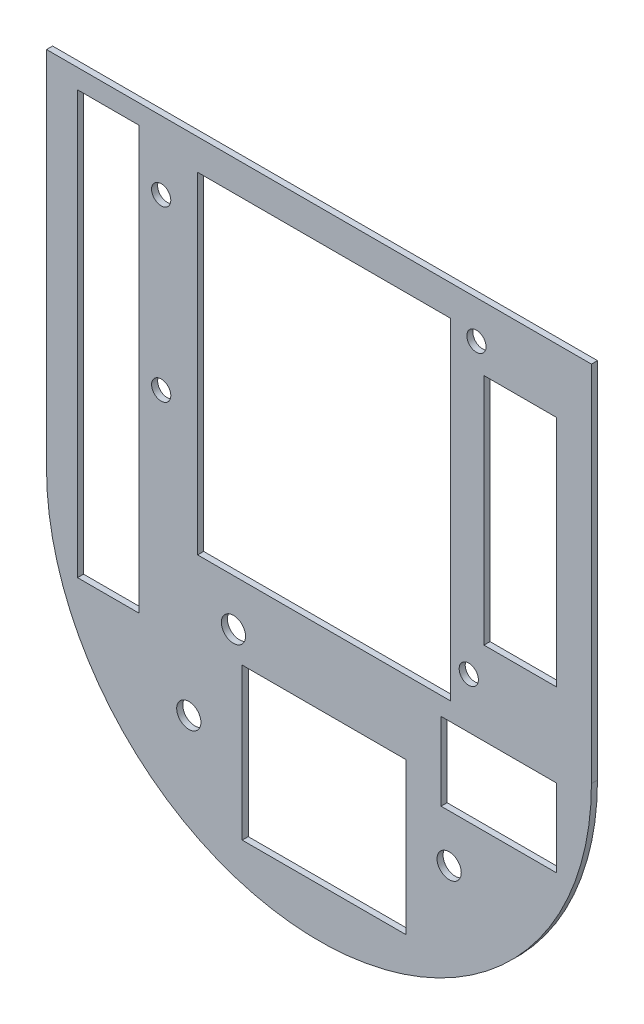
ISO-10303-21;
HEADER;
FILE_DESCRIPTION(('STEP AP214'),'2;1');
FILE_NAME('part.step','',(''),(''),'','','');
FILE_SCHEMA(('AUTOMOTIVE_DESIGN { 1 0 10303 214 1 1 1 1 }'));
ENDSEC;
DATA;
#1=APPLICATION_CONTEXT('core data for automotive mechanical design processes');
#2=APPLICATION_PROTOCOL_DEFINITION('international standard','automotive_design',2000,#1);
#3=PRODUCT_CONTEXT('',#1,'mechanical');
#4=PRODUCT('Part','Part','',(#3));
#5=PRODUCT_RELATED_PRODUCT_CATEGORY('part','',(#4));
#6=PRODUCT_DEFINITION_FORMATION('','',#4);
#7=PRODUCT_DEFINITION_CONTEXT('part definition',#1,'design');
#8=PRODUCT_DEFINITION('design','',#6,#7);
#9=PRODUCT_DEFINITION_SHAPE('','',#8);
#10=(LENGTH_UNIT() NAMED_UNIT(*) SI_UNIT(.MILLI.,.METRE.));
#11=(NAMED_UNIT(*) PLANE_ANGLE_UNIT() SI_UNIT($,.RADIAN.));
#12=(NAMED_UNIT(*) SI_UNIT($,.STERADIAN.) SOLID_ANGLE_UNIT());
#13=UNCERTAINTY_MEASURE_WITH_UNIT(LENGTH_MEASURE(1.E-05),#10,'distance_accuracy_value','');
#14=(GEOMETRIC_REPRESENTATION_CONTEXT(3) GLOBAL_UNCERTAINTY_ASSIGNED_CONTEXT((#13)) GLOBAL_UNIT_ASSIGNED_CONTEXT((#10,
#11,#12)) REPRESENTATION_CONTEXT('',''));
#15=CARTESIAN_POINT('',(0.,0.,0.));
#16=DIRECTION('',(0.,0.,1.));
#17=DIRECTION('',(1.,0.,0.));
#18=AXIS2_PLACEMENT_3D('',#15,#16,#17);
#19=CARTESIAN_POINT('',(16.1099960114476,-18.0642755711846,1.));
#20=DIRECTION('',(0.,0.,1.));
#21=DIRECTION('',(1.,0.,0.));
#22=AXIS2_PLACEMENT_3D('',#19,#20,#21);
#23=PLANE('',#22);
#24=DIRECTION('',(0.,1.,0.));
#25=VECTOR('',#24,1.);
#26=CARTESIAN_POINT('',(-13.5811824956844,-31.0485298295975,1.));
#27=LINE('',#26,#25);
#28=CARTESIAN_POINT('',(-13.5811824956844,-31.0485298295975,1.));
#29=VERTEX_POINT('',#28);
#30=CARTESIAN_POINT('',(-13.5811824956844,38.7363753081951,1.));
#31=VERTEX_POINT('',#30);
#32=EDGE_CURVE('E48',#29,#31,#27,.T.);
#33=ORIENTED_EDGE('',*,*,#32,.F.);
#34=DIRECTION('',(1.,0.,0.));
#35=VECTOR('',#34,1.);
#36=CARTESIAN_POINT('',(-23.773676610073,-31.0485298295975,1.));
#37=LINE('',#36,#35);
#38=CARTESIAN_POINT('',(-23.773676610073,-31.0485298295975,1.));
#39=VERTEX_POINT('',#38);
#40=EDGE_CURVE('E215',#39,#29,#37,.T.);
#41=ORIENTED_EDGE('',*,*,#40,.F.);
#42=DIRECTION('',(0.,-1.,0.));
#43=VECTOR('',#42,1.);
#44=CARTESIAN_POINT('',(-23.773676610073,-31.0485298295975,1.));
#45=LINE('',#44,#43);
#46=CARTESIAN_POINT('',(-23.773676610073,38.7363753081951,1.));
#47=VERTEX_POINT('',#46);
#48=EDGE_CURVE('E218',#47,#39,#45,.T.);
#49=ORIENTED_EDGE('',*,*,#48,.F.);
#50=DIRECTION('',(-1.,0.,0.));
#51=VECTOR('',#50,1.);
#52=CARTESIAN_POINT('',(-23.773676610073,38.7363753081951,1.));
#53=LINE('',#52,#51);
#54=EDGE_CURVE('E224',#31,#47,#53,.T.);
#55=ORIENTED_EDGE('',*,*,#54,.F.);
#56=EDGE_LOOP('',(#33,#41,#49,#55));
#57=FACE_BOUND('',#56,.T.);
#58=DIRECTION('',(0.,-1.,0.));
#59=VECTOR('',#58,1.);
#60=CARTESIAN_POINT('',(3.43092724596415,-54.9902553523783,1.));
#61=LINE('',#60,#59);
#62=CARTESIAN_POINT('',(3.43092724596415,-29.9521719844237,1.));
#63=VERTEX_POINT('',#62);
#64=CARTESIAN_POINT('',(3.43092724596415,-54.9902553523783,1.));
#65=VERTEX_POINT('',#64);
#66=EDGE_CURVE('E56',#63,#65,#61,.T.);
#67=ORIENTED_EDGE('',*,*,#66,.F.);
#68=DIRECTION('',(-1.,0.,0.));
#69=VECTOR('',#68,1.);
#70=CARTESIAN_POINT('',(30.4631942449948,-29.9521719844237,1.));
#71=LINE('',#70,#69);
#72=CARTESIAN_POINT('',(30.4631942449948,-29.9521719844237,1.));
#73=VERTEX_POINT('',#72);
#74=EDGE_CURVE('E239',#73,#63,#71,.T.);
#75=ORIENTED_EDGE('',*,*,#74,.F.);
#76=DIRECTION('',(0.,1.,0.));
#77=VECTOR('',#76,1.);
#78=CARTESIAN_POINT('',(30.4631942449948,-54.9902553523783,1.));
#79=LINE('',#78,#77);
#80=CARTESIAN_POINT('',(30.4631942449948,-54.9902553523783,1.));
#81=VERTEX_POINT('',#80);
#82=EDGE_CURVE('E254',#81,#73,#79,.T.);
#83=ORIENTED_EDGE('',*,*,#82,.F.);
#84=DIRECTION('',(1.,0.,0.));
#85=VECTOR('',#84,1.);
#86=CARTESIAN_POINT('',(30.4631942449948,-54.9902553523783,1.));
#87=LINE('',#86,#85);
#88=EDGE_CURVE('E250',#65,#81,#87,.T.);
#89=ORIENTED_EDGE('',*,*,#88,.F.);
#90=EDGE_LOOP('',(#67,#75,#83,#89));
#91=FACE_BOUND('',#90,.T.);
#92=DIRECTION('',(0.,1.,0.));
#93=VECTOR('',#92,1.);
#94=CARTESIAN_POINT('',(55.3289407559428,-7.12984820655362,1.));
#95=LINE('',#94,#93);
#96=CARTESIAN_POINT('',(55.3289407559428,-7.12984820655362,1.));
#97=VERTEX_POINT('',#96);
#98=CARTESIAN_POINT('',(55.3289407559428,31.4243686609163,1.));
#99=VERTEX_POINT('',#98);
#100=EDGE_CURVE('E279',#97,#99,#95,.T.);
#101=ORIENTED_EDGE('',*,*,#100,.F.);
#102=DIRECTION('',(1.,0.,0.));
#103=VECTOR('',#102,1.);
#104=CARTESIAN_POINT('',(43.3638389694866,-7.12984820655362,1.));
#105=LINE('',#104,#103);
#106=CARTESIAN_POINT('',(43.3638389694866,-7.12984820655362,1.));
#107=VERTEX_POINT('',#106);
#108=EDGE_CURVE('E269',#107,#97,#105,.T.);
#109=ORIENTED_EDGE('',*,*,#108,.F.);
#110=DIRECTION('',(0.,-1.,0.));
#111=VECTOR('',#110,1.);
#112=CARTESIAN_POINT('',(43.3638389694866,-7.12984820655362,1.));
#113=LINE('',#112,#111);
#114=CARTESIAN_POINT('',(43.3638389694866,31.4243686609163,1.));
#115=VERTEX_POINT('',#114);
#116=EDGE_CURVE('E285',#115,#107,#113,.T.);
#117=ORIENTED_EDGE('',*,*,#116,.F.);
#118=DIRECTION('',(-1.,0.,0.));
#119=VECTOR('',#118,1.);
#120=CARTESIAN_POINT('',(43.3638389694866,31.4243686609163,1.));
#121=LINE('',#120,#119);
#122=EDGE_CURVE('E281',#99,#115,#121,.T.);
#123=ORIENTED_EDGE('',*,*,#122,.F.);
#124=EDGE_LOOP('',(#101,#109,#117,#123));
#125=FACE_BOUND('',#124,.T.);
#126=DIRECTION('',(0.,1.,0.));
#127=VECTOR('',#126,1.);
#128=CARTESIAN_POINT('',(55.3289407559428,-33.7189632875673,1.));
#129=LINE('',#128,#127);
#130=CARTESIAN_POINT('',(55.3289407559428,-33.7189632875673,1.));
#131=VERTEX_POINT('',#130);
#132=CARTESIAN_POINT('',(55.3289407559428,-20.8675576650774,1.));
#133=VERTEX_POINT('',#132);
#134=EDGE_CURVE('E311',#131,#133,#129,.T.);
#135=ORIENTED_EDGE('',*,*,#134,.F.);
#136=DIRECTION('',(1.,0.,0.));
#137=VECTOR('',#136,1.);
#138=CARTESIAN_POINT('',(36.2734082812163,-33.7189632875673,1.));
#139=LINE('',#138,#137);
#140=CARTESIAN_POINT('',(36.2734082812163,-33.7189632875673,1.));
#141=VERTEX_POINT('',#140);
#142=EDGE_CURVE('E301',#141,#131,#139,.T.);
#143=ORIENTED_EDGE('',*,*,#142,.F.);
#144=DIRECTION('',(0.,-1.,0.));
#145=VECTOR('',#144,1.);
#146=CARTESIAN_POINT('',(36.2734082812163,-33.7189632875673,1.));
#147=LINE('',#146,#145);
#148=CARTESIAN_POINT('',(36.2734082812163,-20.8675576650774,1.));
#149=VERTEX_POINT('',#148);
#150=EDGE_CURVE('E316',#149,#141,#147,.T.);
#151=ORIENTED_EDGE('',*,*,#150,.F.);
#152=DIRECTION('',(-1.,0.,0.));
#153=VECTOR('',#152,1.);
#154=CARTESIAN_POINT('',(36.2734082812163,-20.8675576650774,1.));
#155=LINE('',#154,#153);
#156=EDGE_CURVE('E313',#133,#149,#155,.T.);
#157=ORIENTED_EDGE('',*,*,#156,.F.);
#158=EDGE_LOOP('',(#135,#143,#151,#157));
#159=FACE_BOUND('',#158,.T.);
#160=DIRECTION('',(0.,-1.,0.));
#161=VECTOR('',#160,1.);
#162=CARTESIAN_POINT('',(-3.93031850331651,-17.8762822184633,1.));
#163=LINE('',#162,#161);
#164=CARTESIAN_POINT('',(-3.93031850331651,36.8529796566232,1.));
#165=VERTEX_POINT('',#164);
#166=CARTESIAN_POINT('',(-3.93031850331651,-17.8762822184633,1.));
#167=VERTEX_POINT('',#166);
#168=EDGE_CURVE('E231',#165,#167,#163,.T.);
#169=ORIENTED_EDGE('',*,*,#168,.F.);
#170=DIRECTION('',(-1.,0.,0.));
#171=VECTOR('',#170,1.);
#172=CARTESIAN_POINT('',(37.8244399942754,36.8529796566232,1.));
#173=LINE('',#172,#171);
#174=CARTESIAN_POINT('',(37.8244399942754,36.8529796566232,1.));
#175=VERTEX_POINT('',#174);
#176=EDGE_CURVE('E332',#175,#165,#173,.T.);
#177=ORIENTED_EDGE('',*,*,#176,.F.);
#178=DIRECTION('',(0.,1.,0.));
#179=VECTOR('',#178,1.);
#180=CARTESIAN_POINT('',(37.8244399942754,-17.8762822184633,1.));
#181=LINE('',#180,#179);
#182=CARTESIAN_POINT('',(37.8244399942754,-17.8762822184633,1.));
#183=VERTEX_POINT('',#182);
#184=EDGE_CURVE('E346',#183,#175,#181,.T.);
#185=ORIENTED_EDGE('',*,*,#184,.F.);
#186=DIRECTION('',(1.,0.,0.));
#187=VECTOR('',#186,1.);
#188=CARTESIAN_POINT('',(37.8244399942754,-17.8762822184633,1.));
#189=LINE('',#188,#187);
#190=EDGE_CURVE('E343',#167,#183,#189,.T.);
#191=ORIENTED_EDGE('',*,*,#190,.F.);
#192=EDGE_LOOP('',(#169,#177,#185,#191));
#193=FACE_BOUND('',#192,.T.);
#194=CARTESIAN_POINT('',(42.1199960114471,35.7118361233288,1.));
#195=DIRECTION('',(0.,0.,1.));
#196=DIRECTION('',(1.,0.,0.));
#197=AXIS2_PLACEMENT_3D('',#194,#195,#196);
#198=CIRCLE('',#197,1.5875);
#199=CARTESIAN_POINT('',(43.7074960114471,35.7118361233288,1.));
#200=VERTEX_POINT('',#199);
#201=EDGE_CURVE('E366',#200,#200,#198,.T.);
#202=ORIENTED_EDGE('',*,*,#201,.F.);
#203=EDGE_LOOP('',(#202));
#204=FACE_BOUND('',#203,.T.);
#205=CARTESIAN_POINT('',(-9.95000398855292,2.69183612332877,1.));
#206=DIRECTION('',(0.,0.,1.));
#207=DIRECTION('',(1.,0.,0.));
#208=AXIS2_PLACEMENT_3D('',#205,#206,#207);
#209=CIRCLE('',#208,1.58750000000001);
#210=CARTESIAN_POINT('',(-8.36250398855291,2.69183612332877,1.));
#211=VERTEX_POINT('',#210);
#212=EDGE_CURVE('E378',#211,#211,#209,.T.);
#213=ORIENTED_EDGE('',*,*,#212,.F.);
#214=EDGE_LOOP('',(#213));
#215=FACE_BOUND('',#214,.T.);
#216=CARTESIAN_POINT('',(-5.39000398855241,-41.5642755711846,1.));
#217=DIRECTION('',(0.,0.,1.));
#218=DIRECTION('',(1.,0.,0.));
#219=AXIS2_PLACEMENT_3D('',#216,#217,#218);
#220=CIRCLE('',#219,2.);
#221=CARTESIAN_POINT('',(-3.39000398855241,-41.5642755711846,1.));
#222=VERTEX_POINT('',#221);
#223=EDGE_CURVE('E390',#222,#222,#220,.T.);
#224=ORIENTED_EDGE('',*,*,#223,.F.);
#225=EDGE_LOOP('',(#224));
#226=FACE_BOUND('',#225,.T.);
#227=DIRECTION('',(-1.,0.,0.));
#228=VECTOR('',#227,1.);
#229=CARTESIAN_POINT('',(61.1099960114476,41.9357244288154,1.));
#230=LINE('',#229,#228);
#231=CARTESIAN_POINT('',(61.1099960114476,41.9357244288154,1.));
#232=VERTEX_POINT('',#231);
#233=CARTESIAN_POINT('',(-28.8900039885524,41.9357244288154,1.));
#234=VERTEX_POINT('',#233);
#235=EDGE_CURVE('E402',#232,#234,#230,.T.);
#236=ORIENTED_EDGE('',*,*,#235,.T.);
#237=DIRECTION('',(0.,-1.,0.));
#238=VECTOR('',#237,1.);
#239=CARTESIAN_POINT('',(-28.8900039885524,41.9357244288154,1.));
#240=LINE('',#239,#238);
#241=CARTESIAN_POINT('',(-28.8900039885524,-18.0642755711846,1.));
#242=VERTEX_POINT('',#241);
#243=EDGE_CURVE('E405',#234,#242,#240,.T.);
#244=ORIENTED_EDGE('',*,*,#243,.T.);
#245=CARTESIAN_POINT('',(16.1099960114476,-18.0642755711846,1.));
#246=DIRECTION('',(0.,0.,1.));
#247=DIRECTION('',(1.,0.,0.));
#248=AXIS2_PLACEMENT_3D('',#245,#246,#247);
#249=CIRCLE('',#248,45.);
#250=CARTESIAN_POINT('',(61.1099960114476,-18.0642755711846,1.));
#251=VERTEX_POINT('',#250);
#252=EDGE_CURVE('E408',#242,#251,#249,.T.);
#253=ORIENTED_EDGE('',*,*,#252,.T.);
#254=DIRECTION('',(0.,1.,0.));
#255=VECTOR('',#254,1.);
#256=CARTESIAN_POINT('',(61.1099960114476,41.9357244288154,1.));
#257=LINE('',#256,#255);
#258=EDGE_CURVE('E410',#251,#232,#257,.T.);
#259=ORIENTED_EDGE('',*,*,#258,.T.);
#260=EDGE_LOOP('',(#236,#244,#253,#259));
#261=FACE_BOUND('',#260,.T.);
#262=CARTESIAN_POINT('',(37.6099960114476,-41.5642755711846,1.));
#263=DIRECTION('',(0.,0.,1.));
#264=DIRECTION('',(1.,0.,0.));
#265=AXIS2_PLACEMENT_3D('',#262,#263,#264);
#266=CIRCLE('',#265,2.);
#267=CARTESIAN_POINT('',(39.6099960114476,-41.5642755711846,1.));
#268=VERTEX_POINT('',#267);
#269=EDGE_CURVE('E396',#268,#268,#266,.T.);
#270=ORIENTED_EDGE('',*,*,#269,.F.);
#271=EDGE_LOOP('',(#270));
#272=FACE_BOUND('',#271,.T.);
#273=CARTESIAN_POINT('',(1.9849960114476,-25.5642755711845,1.));
#274=DIRECTION('',(0.,0.,1.));
#275=DIRECTION('',(1.,0.,0.));
#276=AXIS2_PLACEMENT_3D('',#273,#274,#275);
#277=CIRCLE('',#276,2.);
#278=CARTESIAN_POINT('',(3.98499601144759,-25.5642755711845,1.));
#279=VERTEX_POINT('',#278);
#280=EDGE_CURVE('E384',#279,#279,#277,.T.);
#281=ORIENTED_EDGE('',*,*,#280,.F.);
#282=EDGE_LOOP('',(#281));
#283=FACE_BOUND('',#282,.T.);
#284=CARTESIAN_POINT('',(40.8499960114471,-12.5481638766712,1.));
#285=DIRECTION('',(0.,0.,1.));
#286=DIRECTION('',(1.,0.,0.));
#287=AXIS2_PLACEMENT_3D('',#284,#285,#286);
#288=CIRCLE('',#287,1.58749999999999);
#289=CARTESIAN_POINT('',(42.4374960114471,-12.5481638766712,1.));
#290=VERTEX_POINT('',#289);
#291=EDGE_CURVE('E372',#290,#290,#288,.T.);
#292=ORIENTED_EDGE('',*,*,#291,.F.);
#293=EDGE_LOOP('',(#292));
#294=FACE_BOUND('',#293,.T.);
#295=CARTESIAN_POINT('',(-9.95000398855292,30.6318361233288,1.));
#296=DIRECTION('',(0.,0.,1.));
#297=DIRECTION('',(1.,0.,0.));
#298=AXIS2_PLACEMENT_3D('',#295,#296,#297);
#299=CIRCLE('',#298,1.58750000000001);
#300=CARTESIAN_POINT('',(-8.36250398855291,30.6318361233288,1.));
#301=VERTEX_POINT('',#300);
#302=EDGE_CURVE('E360',#301,#301,#299,.T.);
#303=ORIENTED_EDGE('',*,*,#302,.F.);
#304=EDGE_LOOP('',(#303));
#305=FACE_BOUND('',#304,.T.);
#306=ADVANCED_FACE('F33',(#57,#91,#125,#159,#193,#204,#215,#226,#261,#272,#283,#294,#305),#23,.T.);
#307=CARTESIAN_POINT('',(16.1099960114476,-18.0642755711846,0.));
#308=DIRECTION('',(0.,0.,1.));
#309=DIRECTION('',(1.,0.,0.));
#310=AXIS2_PLACEMENT_3D('',#307,#308,#309);
#311=PLANE('',#310);
#312=DIRECTION('',(1.,0.,0.));
#313=VECTOR('',#312,1.);
#314=CARTESIAN_POINT('',(-23.773676610073,-31.0485298295975,0.));
#315=LINE('',#314,#313);
#316=CARTESIAN_POINT('',(-23.773676610073,-31.0485298295975,0.));
#317=VERTEX_POINT('',#316);
#318=CARTESIAN_POINT('',(-13.5811824956844,-31.0485298295975,0.));
#319=VERTEX_POINT('',#318);
#320=EDGE_CURVE('E202',#317,#319,#315,.T.);
#321=ORIENTED_EDGE('',*,*,#320,.T.);
#322=DIRECTION('',(0.,1.,0.));
#323=VECTOR('',#322,1.);
#324=CARTESIAN_POINT('',(-13.5811824956844,-31.0485298295975,0.));
#325=LINE('',#324,#323);
#326=CARTESIAN_POINT('',(-13.5811824956844,38.7363753081951,0.));
#327=VERTEX_POINT('',#326);
#328=EDGE_CURVE('E196',#319,#327,#325,.T.);
#329=ORIENTED_EDGE('',*,*,#328,.T.);
#330=DIRECTION('',(-1.,0.,0.));
#331=VECTOR('',#330,1.);
#332=CARTESIAN_POINT('',(-23.773676610073,38.7363753081951,0.));
#333=LINE('',#332,#331);
#334=CARTESIAN_POINT('',(-23.773676610073,38.7363753081951,0.));
#335=VERTEX_POINT('',#334);
#336=EDGE_CURVE('E206',#327,#335,#333,.T.);
#337=ORIENTED_EDGE('',*,*,#336,.T.);
#338=DIRECTION('',(0.,-1.,0.));
#339=VECTOR('',#338,1.);
#340=CARTESIAN_POINT('',(-23.773676610073,-31.0485298295975,0.));
#341=LINE('',#340,#339);
#342=EDGE_CURVE('E210',#335,#317,#341,.T.);
#343=ORIENTED_EDGE('',*,*,#342,.T.);
#344=EDGE_LOOP('',(#321,#329,#337,#343));
#345=FACE_BOUND('',#344,.T.);
#346=DIRECTION('',(-1.,0.,0.));
#347=VECTOR('',#346,1.);
#348=CARTESIAN_POINT('',(30.4631942449948,-29.9521719844237,0.));
#349=LINE('',#348,#347);
#350=CARTESIAN_POINT('',(30.4631942449948,-29.9521719844237,0.));
#351=VERTEX_POINT('',#350);
#352=CARTESIAN_POINT('',(3.43092724596415,-29.9521719844237,0.));
#353=VERTEX_POINT('',#352);
#354=EDGE_CURVE('E245',#351,#353,#349,.T.);
#355=ORIENTED_EDGE('',*,*,#354,.T.);
#356=DIRECTION('',(0.,-1.,0.));
#357=VECTOR('',#356,1.);
#358=CARTESIAN_POINT('',(3.43092724596415,-54.9902553523783,0.));
#359=LINE('',#358,#357);
#360=CARTESIAN_POINT('',(3.43092724596415,-54.9902553523783,0.));
#361=VERTEX_POINT('',#360);
#362=EDGE_CURVE('E235',#353,#361,#359,.T.);
#363=ORIENTED_EDGE('',*,*,#362,.T.);
#364=DIRECTION('',(1.,0.,0.));
#365=VECTOR('',#364,1.);
#366=CARTESIAN_POINT('',(30.4631942449948,-54.9902553523783,0.));
#367=LINE('',#366,#365);
#368=CARTESIAN_POINT('',(30.4631942449948,-54.9902553523783,0.));
#369=VERTEX_POINT('',#368);
#370=EDGE_CURVE('E238',#361,#369,#367,.T.);
#371=ORIENTED_EDGE('',*,*,#370,.T.);
#372=DIRECTION('',(0.,1.,0.));
#373=VECTOR('',#372,1.);
#374=CARTESIAN_POINT('',(30.4631942449948,-54.9902553523783,0.));
#375=LINE('',#374,#373);
#376=EDGE_CURVE('E242',#369,#351,#375,.T.);
#377=ORIENTED_EDGE('',*,*,#376,.T.);
#378=EDGE_LOOP('',(#355,#363,#371,#377));
#379=FACE_BOUND('',#378,.T.);
#380=DIRECTION('',(1.,0.,0.));
#381=VECTOR('',#380,1.);
#382=CARTESIAN_POINT('',(43.3638389694866,-7.12984820655362,0.));
#383=LINE('',#382,#381);
#384=CARTESIAN_POINT('',(43.3638389694866,-7.12984820655362,0.));
#385=VERTEX_POINT('',#384);
#386=CARTESIAN_POINT('',(55.3289407559428,-7.12984820655362,0.));
#387=VERTEX_POINT('',#386);
#388=EDGE_CURVE('E275',#385,#387,#383,.T.);
#389=ORIENTED_EDGE('',*,*,#388,.T.);
#390=DIRECTION('',(0.,1.,0.));
#391=VECTOR('',#390,1.);
#392=CARTESIAN_POINT('',(55.3289407559428,-7.12984820655362,0.));
#393=LINE('',#392,#391);
#394=CARTESIAN_POINT('',(55.3289407559428,31.4243686609163,0.));
#395=VERTEX_POINT('',#394);
#396=EDGE_CURVE('E265',#387,#395,#393,.T.);
#397=ORIENTED_EDGE('',*,*,#396,.T.);
#398=DIRECTION('',(-1.,0.,0.));
#399=VECTOR('',#398,1.);
#400=CARTESIAN_POINT('',(43.3638389694866,31.4243686609163,0.));
#401=LINE('',#400,#399);
#402=CARTESIAN_POINT('',(43.3638389694866,31.4243686609163,0.));
#403=VERTEX_POINT('',#402);
#404=EDGE_CURVE('E268',#395,#403,#401,.T.);
#405=ORIENTED_EDGE('',*,*,#404,.T.);
#406=DIRECTION('',(0.,-1.,0.));
#407=VECTOR('',#406,1.);
#408=CARTESIAN_POINT('',(43.3638389694866,-7.12984820655362,0.));
#409=LINE('',#408,#407);
#410=EDGE_CURVE('E272',#403,#385,#409,.T.);
#411=ORIENTED_EDGE('',*,*,#410,.T.);
#412=EDGE_LOOP('',(#389,#397,#405,#411));
#413=FACE_BOUND('',#412,.T.);
#414=DIRECTION('',(1.,0.,0.));
#415=VECTOR('',#414,1.);
#416=CARTESIAN_POINT('',(36.2734082812163,-33.7189632875673,0.));
#417=LINE('',#416,#415);
#418=CARTESIAN_POINT('',(36.2734082812163,-33.7189632875673,0.));
#419=VERTEX_POINT('',#418);
#420=CARTESIAN_POINT('',(55.3289407559428,-33.7189632875673,0.));
#421=VERTEX_POINT('',#420);
#422=EDGE_CURVE('E307',#419,#421,#417,.T.);
#423=ORIENTED_EDGE('',*,*,#422,.T.);
#424=DIRECTION('',(0.,1.,0.));
#425=VECTOR('',#424,1.);
#426=CARTESIAN_POINT('',(55.3289407559428,-33.7189632875673,0.));
#427=LINE('',#426,#425);
#428=CARTESIAN_POINT('',(55.3289407559428,-20.8675576650774,0.));
#429=VERTEX_POINT('',#428);
#430=EDGE_CURVE('E297',#421,#429,#427,.T.);
#431=ORIENTED_EDGE('',*,*,#430,.T.);
#432=DIRECTION('',(-1.,0.,0.));
#433=VECTOR('',#432,1.);
#434=CARTESIAN_POINT('',(36.2734082812163,-20.8675576650774,0.));
#435=LINE('',#434,#433);
#436=CARTESIAN_POINT('',(36.2734082812163,-20.8675576650774,0.));
#437=VERTEX_POINT('',#436);
#438=EDGE_CURVE('E300',#429,#437,#435,.T.);
#439=ORIENTED_EDGE('',*,*,#438,.T.);
#440=DIRECTION('',(0.,-1.,0.));
#441=VECTOR('',#440,1.);
#442=CARTESIAN_POINT('',(36.2734082812163,-33.7189632875673,0.));
#443=LINE('',#442,#441);
#444=EDGE_CURVE('E304',#437,#419,#443,.T.);
#445=ORIENTED_EDGE('',*,*,#444,.T.);
#446=EDGE_LOOP('',(#423,#431,#439,#445));
#447=FACE_BOUND('',#446,.T.);
#448=DIRECTION('',(-1.,0.,0.));
#449=VECTOR('',#448,1.);
#450=CARTESIAN_POINT('',(37.8244399942754,36.8529796566232,0.));
#451=LINE('',#450,#449);
#452=CARTESIAN_POINT('',(37.8244399942754,36.8529796566232,0.));
#453=VERTEX_POINT('',#452);
#454=CARTESIAN_POINT('',(-3.93031850331651,36.8529796566232,0.));
#455=VERTEX_POINT('',#454);
#456=EDGE_CURVE('E338',#453,#455,#451,.T.);
#457=ORIENTED_EDGE('',*,*,#456,.T.);
#458=DIRECTION('',(0.,-1.,0.));
#459=VECTOR('',#458,1.);
#460=CARTESIAN_POINT('',(-3.93031850331651,-17.8762822184633,0.));
#461=LINE('',#460,#459);
#462=CARTESIAN_POINT('',(-3.93031850331651,-17.8762822184633,0.));
#463=VERTEX_POINT('',#462);
#464=EDGE_CURVE('E328',#455,#463,#461,.T.);
#465=ORIENTED_EDGE('',*,*,#464,.T.);
#466=DIRECTION('',(1.,0.,0.));
#467=VECTOR('',#466,1.);
#468=CARTESIAN_POINT('',(37.8244399942754,-17.8762822184633,0.));
#469=LINE('',#468,#467);
#470=CARTESIAN_POINT('',(37.8244399942754,-17.8762822184633,0.));
#471=VERTEX_POINT('',#470);
#472=EDGE_CURVE('E331',#463,#471,#469,.T.);
#473=ORIENTED_EDGE('',*,*,#472,.T.);
#474=DIRECTION('',(0.,1.,0.));
#475=VECTOR('',#474,1.);
#476=CARTESIAN_POINT('',(37.8244399942754,-17.8762822184633,0.));
#477=LINE('',#476,#475);
#478=EDGE_CURVE('E335',#471,#453,#477,.T.);
#479=ORIENTED_EDGE('',*,*,#478,.T.);
#480=EDGE_LOOP('',(#457,#465,#473,#479));
#481=FACE_BOUND('',#480,.T.);
#482=DIRECTION('',(-1.,0.,0.));
#483=VECTOR('',#482,1.);
#484=CARTESIAN_POINT('',(61.1099960114476,41.9357244288154,0.));
#485=LINE('',#484,#483);
#486=CARTESIAN_POINT('',(61.1099960114476,41.9357244288154,0.));
#487=VERTEX_POINT('',#486);
#488=CARTESIAN_POINT('',(-28.8900039885524,41.9357244288154,0.));
#489=VERTEX_POINT('',#488);
#490=EDGE_CURVE('E399',#487,#489,#485,.T.);
#491=ORIENTED_EDGE('',*,*,#490,.F.);
#492=DIRECTION('',(0.,1.,0.));
#493=VECTOR('',#492,1.);
#494=CARTESIAN_POINT('',(61.1099960114476,41.9357244288154,0.));
#495=LINE('',#494,#493);
#496=CARTESIAN_POINT('',(61.1099960114476,-18.0642755711846,0.));
#497=VERTEX_POINT('',#496);
#498=EDGE_CURVE('E406',#497,#487,#495,.T.);
#499=ORIENTED_EDGE('',*,*,#498,.F.);
#500=CARTESIAN_POINT('',(16.1099960114476,-18.0642755711846,0.));
#501=DIRECTION('',(0.,0.,1.));
#502=DIRECTION('',(1.,0.,0.));
#503=AXIS2_PLACEMENT_3D('',#500,#501,#502);
#504=CIRCLE('',#503,45.);
#505=CARTESIAN_POINT('',(-28.8900039885524,-18.0642755711846,0.));
#506=VERTEX_POINT('',#505);
#507=EDGE_CURVE('E417',#506,#497,#504,.T.);
#508=ORIENTED_EDGE('',*,*,#507,.F.);
#509=DIRECTION('',(0.,-1.,0.));
#510=VECTOR('',#509,1.);
#511=CARTESIAN_POINT('',(-28.8900039885524,41.9357244288154,0.));
#512=LINE('',#511,#510);
#513=EDGE_CURVE('E415',#489,#506,#512,.T.);
#514=ORIENTED_EDGE('',*,*,#513,.F.);
#515=EDGE_LOOP('',(#491,#499,#508,#514));
#516=FACE_BOUND('',#515,.T.);
#517=CARTESIAN_POINT('',(37.6099960114476,-41.5642755711846,0.));
#518=DIRECTION('',(0.,0.,1.));
#519=DIRECTION('',(1.,0.,0.));
#520=AXIS2_PLACEMENT_3D('',#517,#518,#519);
#521=CIRCLE('',#520,2.);
#522=CARTESIAN_POINT('',(39.6099960114476,-41.5642755711846,0.));
#523=VERTEX_POINT('',#522);
#524=EDGE_CURVE('E393',#523,#523,#521,.T.);
#525=ORIENTED_EDGE('',*,*,#524,.T.);
#526=EDGE_LOOP('',(#525));
#527=FACE_BOUND('',#526,.T.);
#528=CARTESIAN_POINT('',(-5.39000398855241,-41.5642755711846,0.));
#529=DIRECTION('',(0.,0.,1.));
#530=DIRECTION('',(1.,0.,0.));
#531=AXIS2_PLACEMENT_3D('',#528,#529,#530);
#532=CIRCLE('',#531,2.);
#533=CARTESIAN_POINT('',(-3.39000398855241,-41.5642755711846,0.));
#534=VERTEX_POINT('',#533);
#535=EDGE_CURVE('E387',#534,#534,#532,.T.);
#536=ORIENTED_EDGE('',*,*,#535,.T.);
#537=EDGE_LOOP('',(#536));
#538=FACE_BOUND('',#537,.T.);
#539=CARTESIAN_POINT('',(1.9849960114476,-25.5642755711845,0.));
#540=DIRECTION('',(0.,0.,1.));
#541=DIRECTION('',(1.,0.,0.));
#542=AXIS2_PLACEMENT_3D('',#539,#540,#541);
#543=CIRCLE('',#542,2.);
#544=CARTESIAN_POINT('',(3.98499601144759,-25.5642755711845,0.));
#545=VERTEX_POINT('',#544);
#546=EDGE_CURVE('E381',#545,#545,#543,.T.);
#547=ORIENTED_EDGE('',*,*,#546,.T.);
#548=EDGE_LOOP('',(#547));
#549=FACE_BOUND('',#548,.T.);
#550=CARTESIAN_POINT('',(-9.95000398855292,2.69183612332877,0.));
#551=DIRECTION('',(0.,0.,1.));
#552=DIRECTION('',(1.,0.,0.));
#553=AXIS2_PLACEMENT_3D('',#550,#551,#552);
#554=CIRCLE('',#553,1.58750000000001);
#555=CARTESIAN_POINT('',(-8.36250398855291,2.69183612332877,0.));
#556=VERTEX_POINT('',#555);
#557=EDGE_CURVE('E375',#556,#556,#554,.T.);
#558=ORIENTED_EDGE('',*,*,#557,.T.);
#559=EDGE_LOOP('',(#558));
#560=FACE_BOUND('',#559,.T.);
#561=CARTESIAN_POINT('',(40.8499960114471,-12.5481638766712,0.));
#562=DIRECTION('',(0.,0.,1.));
#563=DIRECTION('',(1.,0.,0.));
#564=AXIS2_PLACEMENT_3D('',#561,#562,#563);
#565=CIRCLE('',#564,1.58749999999999);
#566=CARTESIAN_POINT('',(42.4374960114471,-12.5481638766712,0.));
#567=VERTEX_POINT('',#566);
#568=EDGE_CURVE('E369',#567,#567,#565,.T.);
#569=ORIENTED_EDGE('',*,*,#568,.T.);
#570=EDGE_LOOP('',(#569));
#571=FACE_BOUND('',#570,.T.);
#572=CARTESIAN_POINT('',(42.1199960114471,35.7118361233288,0.));
#573=DIRECTION('',(0.,0.,1.));
#574=DIRECTION('',(1.,0.,0.));
#575=AXIS2_PLACEMENT_3D('',#572,#573,#574);
#576=CIRCLE('',#575,1.5875);
#577=CARTESIAN_POINT('',(43.7074960114471,35.7118361233288,0.));
#578=VERTEX_POINT('',#577);
#579=EDGE_CURVE('E363',#578,#578,#576,.T.);
#580=ORIENTED_EDGE('',*,*,#579,.T.);
#581=EDGE_LOOP('',(#580));
#582=FACE_BOUND('',#581,.T.);
#583=CARTESIAN_POINT('',(-9.95000398855292,30.6318361233288,0.));
#584=DIRECTION('',(0.,0.,1.));
#585=DIRECTION('',(1.,0.,0.));
#586=AXIS2_PLACEMENT_3D('',#583,#584,#585);
#587=CIRCLE('',#586,1.58750000000001);
#588=CARTESIAN_POINT('',(-8.36250398855291,30.6318361233288,0.));
#589=VERTEX_POINT('',#588);
#590=EDGE_CURVE('E353',#589,#589,#587,.T.);
#591=ORIENTED_EDGE('',*,*,#590,.T.);
#592=EDGE_LOOP('',(#591));
#593=FACE_BOUND('',#592,.T.);
#594=ADVANCED_FACE('F212',(#345,#379,#413,#447,#481,#516,#527,#538,#549,#560,#571,#582,#593),
#311,.F.);
#595=CARTESIAN_POINT('',(61.1099960114476,41.9357244288154,1.));
#596=DIRECTION('',(0.,-1.,0.));
#597=DIRECTION('',(1.,0.,0.));
#598=AXIS2_PLACEMENT_3D('',#595,#596,#597);
#599=PLANE('',#598);
#600=ORIENTED_EDGE('',*,*,#490,.T.);
#601=DIRECTION('',(0.,0.,-1.));
#602=VECTOR('',#601,1.);
#603=CARTESIAN_POINT('',(-28.8900039885524,41.9357244288154,1.));
#604=LINE('',#603,#602);
#605=EDGE_CURVE('E11',#234,#489,#604,.T.);
#606=ORIENTED_EDGE('',*,*,#605,.F.);
#607=ORIENTED_EDGE('',*,*,#235,.F.);
#608=DIRECTION('',(0.,0.,-1.));
#609=VECTOR('',#608,1.);
#610=CARTESIAN_POINT('',(61.1099960114476,41.9357244288154,1.));
#611=LINE('',#610,#609);
#612=EDGE_CURVE('E412',#232,#487,#611,.T.);
#613=ORIENTED_EDGE('',*,*,#612,.T.);
#614=EDGE_LOOP('',(#600,#606,#607,#613));
#615=FACE_BOUND('',#614,.T.);
#616=ADVANCED_FACE('F35',(#615),#599,.F.);
#617=CARTESIAN_POINT('',(-28.8900039885524,41.9357244288154,1.));
#618=DIRECTION('',(1.,0.,0.));
#619=DIRECTION('',(0.,0.,-1.));
#620=AXIS2_PLACEMENT_3D('',#617,#618,#619);
#621=PLANE('',#620);
#622=ORIENTED_EDGE('',*,*,#513,.T.);
#623=DIRECTION('',(0.,0.,-1.));
#624=VECTOR('',#623,1.);
#625=CARTESIAN_POINT('',(-28.8900039885524,-18.0642755711846,1.));
#626=LINE('',#625,#624);
#627=EDGE_CURVE('E41',#242,#506,#626,.T.);
#628=ORIENTED_EDGE('',*,*,#627,.F.);
#629=ORIENTED_EDGE('',*,*,#243,.F.);
#630=ORIENTED_EDGE('',*,*,#605,.T.);
#631=EDGE_LOOP('',(#622,#628,#629,#630));
#632=FACE_BOUND('',#631,.T.);
#633=ADVANCED_FACE('F445',(#632),#621,.F.);
#634=CARTESIAN_POINT('',(16.1099960114476,-18.0642755711846,1.));
#635=DIRECTION('',(0.,0.,-1.));
#636=DIRECTION('',(-1.,0.,0.));
#637=AXIS2_PLACEMENT_3D('',#634,#635,#636);
#638=CYLINDRICAL_SURFACE('',#637,45.);
#639=ORIENTED_EDGE('',*,*,#507,.T.);
#640=DIRECTION('',(0.,0.,-1.));
#641=VECTOR('',#640,1.);
#642=CARTESIAN_POINT('',(61.1099960114476,-18.0642755711846,1.));
#643=LINE('',#642,#641);
#644=EDGE_CURVE('E422',#251,#497,#643,.T.);
#645=ORIENTED_EDGE('',*,*,#644,.F.);
#646=ORIENTED_EDGE('',*,*,#252,.F.);
#647=ORIENTED_EDGE('',*,*,#627,.T.);
#648=EDGE_LOOP('',(#639,#645,#646,#647));
#649=FACE_BOUND('',#648,.T.);
#650=ADVANCED_FACE('F429',(#649),#638,.T.);
#651=CARTESIAN_POINT('',(61.1099960114476,41.9357244288154,1.));
#652=DIRECTION('',(-1.,0.,0.));
#653=DIRECTION('',(0.,0.,1.));
#654=AXIS2_PLACEMENT_3D('',#651,#652,#653);
#655=PLANE('',#654);
#656=ORIENTED_EDGE('',*,*,#498,.T.);
#657=ORIENTED_EDGE('',*,*,#612,.F.);
#658=ORIENTED_EDGE('',*,*,#258,.F.);
#659=ORIENTED_EDGE('',*,*,#644,.T.);
#660=EDGE_LOOP('',(#656,#657,#658,#659));
#661=FACE_BOUND('',#660,.T.);
#662=ADVANCED_FACE('F438',(#661),#655,.F.);
#663=CARTESIAN_POINT('',(37.6099960114476,-41.5642755711846,1.));
#664=DIRECTION('',(0.,0.,-1.));
#665=DIRECTION('',(-1.,0.,0.));
#666=AXIS2_PLACEMENT_3D('',#663,#664,#665);
#667=CYLINDRICAL_SURFACE('',#666,2.);
#668=ORIENTED_EDGE('',*,*,#269,.T.);
#669=EDGE_LOOP('',(#668));
#670=FACE_BOUND('',#669,.T.);
#671=ORIENTED_EDGE('',*,*,#524,.F.);
#672=EDGE_LOOP('',(#671));
#673=FACE_BOUND('',#672,.T.);
#674=ADVANCED_FACE('F461',(#670,#673),#667,.F.);
#675=CARTESIAN_POINT('',(-5.39000398855241,-41.5642755711846,1.));
#676=DIRECTION('',(0.,0.,-1.));
#677=DIRECTION('',(-1.,0.,0.));
#678=AXIS2_PLACEMENT_3D('',#675,#676,#677);
#679=CYLINDRICAL_SURFACE('',#678,2.);
#680=ORIENTED_EDGE('',*,*,#223,.T.);
#681=EDGE_LOOP('',(#680));
#682=FACE_BOUND('',#681,.T.);
#683=ORIENTED_EDGE('',*,*,#535,.F.);
#684=EDGE_LOOP('',(#683));
#685=FACE_BOUND('',#684,.T.);
#686=ADVANCED_FACE('F468',(#682,#685),#679,.F.);
#687=CARTESIAN_POINT('',(1.9849960114476,-25.5642755711845,1.));
#688=DIRECTION('',(0.,0.,-1.));
#689=DIRECTION('',(-1.,0.,0.));
#690=AXIS2_PLACEMENT_3D('',#687,#688,#689);
#691=CYLINDRICAL_SURFACE('',#690,2.);
#692=ORIENTED_EDGE('',*,*,#280,.T.);
#693=EDGE_LOOP('',(#692));
#694=FACE_BOUND('',#693,.T.);
#695=ORIENTED_EDGE('',*,*,#546,.F.);
#696=EDGE_LOOP('',(#695));
#697=FACE_BOUND('',#696,.T.);
#698=ADVANCED_FACE('F473',(#694,#697),#691,.F.);
#699=CARTESIAN_POINT('',(-9.95000398855292,2.69183612332877,1.));
#700=DIRECTION('',(0.,0.,-1.));
#701=DIRECTION('',(-1.,0.,0.));
#702=AXIS2_PLACEMENT_3D('',#699,#700,#701);
#703=CYLINDRICAL_SURFACE('',#702,1.58750000000001);
#704=ORIENTED_EDGE('',*,*,#212,.T.);
#705=EDGE_LOOP('',(#704));
#706=FACE_BOUND('',#705,.T.);
#707=ORIENTED_EDGE('',*,*,#557,.F.);
#708=EDGE_LOOP('',(#707));
#709=FACE_BOUND('',#708,.T.);
#710=ADVANCED_FACE('F511',(#706,#709),#703,.F.);
#711=CARTESIAN_POINT('',(40.8499960114471,-12.5481638766712,1.));
#712=DIRECTION('',(0.,0.,-1.));
#713=DIRECTION('',(-1.,0.,0.));
#714=AXIS2_PLACEMENT_3D('',#711,#712,#713);
#715=CYLINDRICAL_SURFACE('',#714,1.58749999999999);
#716=ORIENTED_EDGE('',*,*,#291,.T.);
#717=EDGE_LOOP('',(#716));
#718=FACE_BOUND('',#717,.T.);
#719=ORIENTED_EDGE('',*,*,#568,.F.);
#720=EDGE_LOOP('',(#719));
#721=FACE_BOUND('',#720,.T.);
#722=ADVANCED_FACE('F504',(#718,#721),#715,.F.);
#723=CARTESIAN_POINT('',(42.1199960114471,35.7118361233288,1.));
#724=DIRECTION('',(0.,0.,-1.));
#725=DIRECTION('',(-1.,0.,0.));
#726=AXIS2_PLACEMENT_3D('',#723,#724,#725);
#727=CYLINDRICAL_SURFACE('',#726,1.5875);
#728=ORIENTED_EDGE('',*,*,#201,.T.);
#729=EDGE_LOOP('',(#728));
#730=FACE_BOUND('',#729,.T.);
#731=ORIENTED_EDGE('',*,*,#579,.F.);
#732=EDGE_LOOP('',(#731));
#733=FACE_BOUND('',#732,.T.);
#734=ADVANCED_FACE('F494',(#730,#733),#727,.F.);
#735=CARTESIAN_POINT('',(-9.95000398855292,30.6318361233288,1.));
#736=DIRECTION('',(0.,0.,-1.));
#737=DIRECTION('',(-1.,0.,0.));
#738=AXIS2_PLACEMENT_3D('',#735,#736,#737);
#739=CYLINDRICAL_SURFACE('',#738,1.58750000000001);
#740=ORIENTED_EDGE('',*,*,#302,.T.);
#741=EDGE_LOOP('',(#740));
#742=FACE_BOUND('',#741,.T.);
#743=ORIENTED_EDGE('',*,*,#590,.F.);
#744=EDGE_LOOP('',(#743));
#745=FACE_BOUND('',#744,.T.);
#746=ADVANCED_FACE('F491',(#742,#745),#739,.F.);
#747=CARTESIAN_POINT('',(-3.93031850331651,-17.8762822184633,0.));
#748=DIRECTION('',(-1.,0.,0.));
#749=DIRECTION('',(0.,0.,1.));
#750=AXIS2_PLACEMENT_3D('',#747,#748,#749);
#751=PLANE('',#750);
#752=ORIENTED_EDGE('',*,*,#168,.T.);
#753=DIRECTION('',(0.,0.,1.));
#754=VECTOR('',#753,1.);
#755=CARTESIAN_POINT('',(-3.93031850331651,-17.8762822184633,0.));
#756=LINE('',#755,#754);
#757=EDGE_CURVE('E341',#463,#167,#756,.T.);
#758=ORIENTED_EDGE('',*,*,#757,.F.);
#759=ORIENTED_EDGE('',*,*,#464,.F.);
#760=DIRECTION('',(0.,0.,1.));
#761=VECTOR('',#760,1.);
#762=CARTESIAN_POINT('',(-3.93031850331651,36.8529796566232,0.));
#763=LINE('',#762,#761);
#764=EDGE_CURVE('E351',#455,#165,#763,.T.);
#765=ORIENTED_EDGE('',*,*,#764,.T.);
#766=EDGE_LOOP('',(#752,#758,#759,#765));
#767=FACE_BOUND('',#766,.T.);
#768=ADVANCED_FACE('F493',(#767),#751,.F.);
#769=CARTESIAN_POINT('',(37.8244399942754,36.8529796566232,0.));
#770=DIRECTION('',(0.,1.,0.));
#771=DIRECTION('',(0.,0.,1.));
#772=AXIS2_PLACEMENT_3D('',#769,#770,#771);
#773=PLANE('',#772);
#774=ORIENTED_EDGE('',*,*,#176,.T.);
#775=ORIENTED_EDGE('',*,*,#764,.F.);
#776=ORIENTED_EDGE('',*,*,#456,.F.);
#777=DIRECTION('',(0.,0.,1.));
#778=VECTOR('',#777,1.);
#779=CARTESIAN_POINT('',(37.8244399942754,36.8529796566232,0.));
#780=LINE('',#779,#778);
#781=EDGE_CURVE('E354',#453,#175,#780,.T.);
#782=ORIENTED_EDGE('',*,*,#781,.T.);
#783=EDGE_LOOP('',(#774,#775,#776,#782));
#784=FACE_BOUND('',#783,.T.);
#785=ADVANCED_FACE('F501',(#784),#773,.F.);
#786=CARTESIAN_POINT('',(37.8244399942754,-17.8762822184633,0.));
#787=DIRECTION('',(1.,0.,0.));
#788=DIRECTION('',(0.,0.,-1.));
#789=AXIS2_PLACEMENT_3D('',#786,#787,#788);
#790=PLANE('',#789);
#791=ORIENTED_EDGE('',*,*,#184,.T.);
#792=ORIENTED_EDGE('',*,*,#781,.F.);
#793=ORIENTED_EDGE('',*,*,#478,.F.);
#794=DIRECTION('',(0.,0.,1.));
#795=VECTOR('',#794,1.);
#796=CARTESIAN_POINT('',(37.8244399942754,-17.8762822184633,0.));
#797=LINE('',#796,#795);
#798=EDGE_CURVE('E356',#471,#183,#797,.T.);
#799=ORIENTED_EDGE('',*,*,#798,.T.);
#800=EDGE_LOOP('',(#791,#792,#793,#799));
#801=FACE_BOUND('',#800,.T.);
#802=ADVANCED_FACE('F572',(#801),#790,.F.);
#803=CARTESIAN_POINT('',(37.8244399942754,-17.8762822184633,0.));
#804=DIRECTION('',(0.,-1.,0.));
#805=DIRECTION('',(1.,0.,0.));
#806=AXIS2_PLACEMENT_3D('',#803,#804,#805);
#807=PLANE('',#806);
#808=ORIENTED_EDGE('',*,*,#190,.T.);
#809=ORIENTED_EDGE('',*,*,#798,.F.);
#810=ORIENTED_EDGE('',*,*,#472,.F.);
#811=ORIENTED_EDGE('',*,*,#757,.T.);
#812=EDGE_LOOP('',(#808,#809,#810,#811));
#813=FACE_BOUND('',#812,.T.);
#814=ADVANCED_FACE('F582',(#813),#807,.F.);
#815=CARTESIAN_POINT('',(55.3289407559428,-33.7189632875673,0.));
#816=DIRECTION('',(1.,0.,0.));
#817=DIRECTION('',(0.,0.,-1.));
#818=AXIS2_PLACEMENT_3D('',#815,#816,#817);
#819=PLANE('',#818);
#820=ORIENTED_EDGE('',*,*,#134,.T.);
#821=DIRECTION('',(0.,0.,1.));
#822=VECTOR('',#821,1.);
#823=CARTESIAN_POINT('',(55.3289407559428,-20.8675576650774,0.));
#824=LINE('',#823,#822);
#825=EDGE_CURVE('E310',#429,#133,#824,.T.);
#826=ORIENTED_EDGE('',*,*,#825,.F.);
#827=ORIENTED_EDGE('',*,*,#430,.F.);
#828=DIRECTION('',(0.,0.,1.));
#829=VECTOR('',#828,1.);
#830=CARTESIAN_POINT('',(55.3289407559428,-33.7189632875673,0.));
#831=LINE('',#830,#829);
#832=EDGE_CURVE('E282',#421,#131,#831,.T.);
#833=ORIENTED_EDGE('',*,*,#832,.T.);
#834=EDGE_LOOP('',(#820,#826,#827,#833));
#835=FACE_BOUND('',#834,.T.);
#836=ADVANCED_FACE('F592',(#835),#819,.F.);
#837=CARTESIAN_POINT('',(36.2734082812163,-33.7189632875673,0.));
#838=DIRECTION('',(0.,-1.,0.));
#839=DIRECTION('',(0.,0.,-1.));
#840=AXIS2_PLACEMENT_3D('',#837,#838,#839);
#841=PLANE('',#840);
#842=ORIENTED_EDGE('',*,*,#142,.T.);
#843=ORIENTED_EDGE('',*,*,#832,.F.);
#844=ORIENTED_EDGE('',*,*,#422,.F.);
#845=DIRECTION('',(0.,0.,1.));
#846=VECTOR('',#845,1.);
#847=CARTESIAN_POINT('',(36.2734082812163,-33.7189632875673,0.));
#848=LINE('',#847,#846);
#849=EDGE_CURVE('E322',#419,#141,#848,.T.);
#850=ORIENTED_EDGE('',*,*,#849,.T.);
#851=EDGE_LOOP('',(#842,#843,#844,#850));
#852=FACE_BOUND('',#851,.T.);
#853=ADVANCED_FACE('F601',(#852),#841,.F.);
#854=CARTESIAN_POINT('',(36.2734082812163,-33.7189632875673,0.));
#855=DIRECTION('',(-1.,0.,0.));
#856=DIRECTION('',(0.,0.,1.));
#857=AXIS2_PLACEMENT_3D('',#854,#855,#856);
#858=PLANE('',#857);
#859=ORIENTED_EDGE('',*,*,#150,.T.);
#860=ORIENTED_EDGE('',*,*,#849,.F.);
#861=ORIENTED_EDGE('',*,*,#444,.F.);
#862=DIRECTION('',(0.,0.,1.));
#863=VECTOR('',#862,1.);
#864=CARTESIAN_POINT('',(36.2734082812163,-20.8675576650774,0.));
#865=LINE('',#864,#863);
#866=EDGE_CURVE('E324',#437,#149,#865,.T.);
#867=ORIENTED_EDGE('',*,*,#866,.T.);
#868=EDGE_LOOP('',(#859,#860,#861,#867));
#869=FACE_BOUND('',#868,.T.);
#870=ADVANCED_FACE('F611',(#869),#858,.F.);
#871=CARTESIAN_POINT('',(36.2734082812163,-20.8675576650774,0.));
#872=DIRECTION('',(0.,1.,0.));
#873=DIRECTION('',(0.,0.,1.));
#874=AXIS2_PLACEMENT_3D('',#871,#872,#873);
#875=PLANE('',#874);
#876=ORIENTED_EDGE('',*,*,#156,.T.);
#877=ORIENTED_EDGE('',*,*,#866,.F.);
#878=ORIENTED_EDGE('',*,*,#438,.F.);
#879=ORIENTED_EDGE('',*,*,#825,.T.);
#880=EDGE_LOOP('',(#876,#877,#878,#879));
#881=FACE_BOUND('',#880,.T.);
#882=ADVANCED_FACE('F621',(#881),#875,.F.);
#883=CARTESIAN_POINT('',(55.3289407559428,-7.12984820655362,0.));
#884=DIRECTION('',(1.,0.,0.));
#885=DIRECTION('',(0.,0.,-1.));
#886=AXIS2_PLACEMENT_3D('',#883,#884,#885);
#887=PLANE('',#886);
#888=ORIENTED_EDGE('',*,*,#100,.T.);
#889=DIRECTION('',(0.,0.,1.));
#890=VECTOR('',#889,1.);
#891=CARTESIAN_POINT('',(55.3289407559428,31.4243686609163,0.));
#892=LINE('',#891,#890);
#893=EDGE_CURVE('E278',#395,#99,#892,.T.);
#894=ORIENTED_EDGE('',*,*,#893,.F.);
#895=ORIENTED_EDGE('',*,*,#396,.F.);
#896=DIRECTION('',(0.,0.,1.));
#897=VECTOR('',#896,1.);
#898=CARTESIAN_POINT('',(55.3289407559428,-7.12984820655362,0.));
#899=LINE('',#898,#897);
#900=EDGE_CURVE('E251',#387,#97,#899,.T.);
#901=ORIENTED_EDGE('',*,*,#900,.T.);
#902=EDGE_LOOP('',(#888,#894,#895,#901));
#903=FACE_BOUND('',#902,.T.);
#904=ADVANCED_FACE('F631',(#903),#887,.F.);
#905=CARTESIAN_POINT('',(43.3638389694866,-7.12984820655362,0.));
#906=DIRECTION('',(0.,-1.,0.));
#907=DIRECTION('',(0.,0.,-1.));
#908=AXIS2_PLACEMENT_3D('',#905,#906,#907);
#909=PLANE('',#908);
#910=ORIENTED_EDGE('',*,*,#108,.T.);
#911=ORIENTED_EDGE('',*,*,#900,.F.);
#912=ORIENTED_EDGE('',*,*,#388,.F.);
#913=DIRECTION('',(0.,0.,1.));
#914=VECTOR('',#913,1.);
#915=CARTESIAN_POINT('',(43.3638389694866,-7.12984820655362,0.));
#916=LINE('',#915,#914);
#917=EDGE_CURVE('E291',#385,#107,#916,.T.);
#918=ORIENTED_EDGE('',*,*,#917,.T.);
#919=EDGE_LOOP('',(#910,#911,#912,#918));
#920=FACE_BOUND('',#919,.T.);
#921=ADVANCED_FACE('F641',(#920),#909,.F.);
#922=CARTESIAN_POINT('',(43.3638389694866,-7.12984820655362,0.));
#923=DIRECTION('',(-1.,0.,0.));
#924=DIRECTION('',(0.,0.,1.));
#925=AXIS2_PLACEMENT_3D('',#922,#923,#924);
#926=PLANE('',#925);
#927=ORIENTED_EDGE('',*,*,#116,.T.);
#928=ORIENTED_EDGE('',*,*,#917,.F.);
#929=ORIENTED_EDGE('',*,*,#410,.F.);
#930=DIRECTION('',(0.,0.,1.));
#931=VECTOR('',#930,1.);
#932=CARTESIAN_POINT('',(43.3638389694866,31.4243686609163,0.));
#933=LINE('',#932,#931);
#934=EDGE_CURVE('E293',#403,#115,#933,.T.);
#935=ORIENTED_EDGE('',*,*,#934,.T.);
#936=EDGE_LOOP('',(#927,#928,#929,#935));
#937=FACE_BOUND('',#936,.T.);
#938=ADVANCED_FACE('F651',(#937),#926,.F.);
#939=CARTESIAN_POINT('',(43.3638389694866,31.4243686609163,0.));
#940=DIRECTION('',(0.,1.,0.));
#941=DIRECTION('',(0.,0.,1.));
#942=AXIS2_PLACEMENT_3D('',#939,#940,#941);
#943=PLANE('',#942);
#944=ORIENTED_EDGE('',*,*,#122,.T.);
#945=ORIENTED_EDGE('',*,*,#934,.F.);
#946=ORIENTED_EDGE('',*,*,#404,.F.);
#947=ORIENTED_EDGE('',*,*,#893,.T.);
#948=EDGE_LOOP('',(#944,#945,#946,#947));
#949=FACE_BOUND('',#948,.T.);
#950=ADVANCED_FACE('F661',(#949),#943,.F.);
#951=CARTESIAN_POINT('',(3.43092724596415,-54.9902553523783,0.));
#952=DIRECTION('',(-1.,0.,0.));
#953=DIRECTION('',(0.,0.,1.));
#954=AXIS2_PLACEMENT_3D('',#951,#952,#953);
#955=PLANE('',#954);
#956=ORIENTED_EDGE('',*,*,#66,.T.);
#957=DIRECTION('',(0.,0.,1.));
#958=VECTOR('',#957,1.);
#959=CARTESIAN_POINT('',(3.43092724596415,-54.9902553523783,0.));
#960=LINE('',#959,#958);
#961=EDGE_CURVE('E248',#361,#65,#960,.T.);
#962=ORIENTED_EDGE('',*,*,#961,.F.);
#963=ORIENTED_EDGE('',*,*,#362,.F.);
#964=DIRECTION('',(0.,0.,1.));
#965=VECTOR('',#964,1.);
#966=CARTESIAN_POINT('',(3.43092724596415,-29.9521719844237,0.));
#967=LINE('',#966,#965);
#968=EDGE_CURVE('E225',#353,#63,#967,.T.);
#969=ORIENTED_EDGE('',*,*,#968,.T.);
#970=EDGE_LOOP('',(#956,#962,#963,#969));
#971=FACE_BOUND('',#970,.T.);
#972=ADVANCED_FACE('F671',(#971),#955,.F.);
#973=CARTESIAN_POINT('',(30.4631942449948,-29.9521719844237,0.));
#974=DIRECTION('',(0.,1.,0.));
#975=DIRECTION('',(0.,0.,1.));
#976=AXIS2_PLACEMENT_3D('',#973,#974,#975);
#977=PLANE('',#976);
#978=ORIENTED_EDGE('',*,*,#74,.T.);
#979=ORIENTED_EDGE('',*,*,#968,.F.);
#980=ORIENTED_EDGE('',*,*,#354,.F.);
#981=DIRECTION('',(0.,0.,1.));
#982=VECTOR('',#981,1.);
#983=CARTESIAN_POINT('',(30.4631942449948,-29.9521719844237,0.));
#984=LINE('',#983,#982);
#985=EDGE_CURVE('E260',#351,#73,#984,.T.);
#986=ORIENTED_EDGE('',*,*,#985,.T.);
#987=EDGE_LOOP('',(#978,#979,#980,#986));
#988=FACE_BOUND('',#987,.T.);
#989=ADVANCED_FACE('F681',(#988),#977,.F.);
#990=CARTESIAN_POINT('',(30.4631942449948,-54.9902553523783,0.));
#991=DIRECTION('',(1.,0.,0.));
#992=DIRECTION('',(0.,0.,-1.));
#993=AXIS2_PLACEMENT_3D('',#990,#991,#992);
#994=PLANE('',#993);
#995=ORIENTED_EDGE('',*,*,#82,.T.);
#996=ORIENTED_EDGE('',*,*,#985,.F.);
#997=ORIENTED_EDGE('',*,*,#376,.F.);
#998=DIRECTION('',(0.,0.,1.));
#999=VECTOR('',#998,1.);
#1000=CARTESIAN_POINT('',(30.4631942449948,-54.9902553523783,0.));
#1001=LINE('',#1000,#999);
#1002=EDGE_CURVE('E262',#369,#81,#1001,.T.);
#1003=ORIENTED_EDGE('',*,*,#1002,.T.);
#1004=EDGE_LOOP('',(#995,#996,#997,#1003));
#1005=FACE_BOUND('',#1004,.T.);
#1006=ADVANCED_FACE('F690',(#1005),#994,.F.);
#1007=CARTESIAN_POINT('',(30.4631942449948,-54.9902553523783,0.));
#1008=DIRECTION('',(0.,-1.,0.));
#1009=DIRECTION('',(0.,0.,-1.));
#1010=AXIS2_PLACEMENT_3D('',#1007,#1008,#1009);
#1011=PLANE('',#1010);
#1012=ORIENTED_EDGE('',*,*,#88,.T.);
#1013=ORIENTED_EDGE('',*,*,#1002,.F.);
#1014=ORIENTED_EDGE('',*,*,#370,.F.);
#1015=ORIENTED_EDGE('',*,*,#961,.T.);
#1016=EDGE_LOOP('',(#1012,#1013,#1014,#1015));
#1017=FACE_BOUND('',#1016,.T.);
#1018=ADVANCED_FACE('F700',(#1017),#1011,.F.);
#1019=CARTESIAN_POINT('',(-13.5811824956844,-31.0485298295975,0.));
#1020=DIRECTION('',(1.,0.,0.));
#1021=DIRECTION('',(0.,0.,-1.));
#1022=AXIS2_PLACEMENT_3D('',#1019,#1020,#1021);
#1023=PLANE('',#1022);
#1024=ORIENTED_EDGE('',*,*,#32,.T.);
#1025=DIRECTION('',(0.,0.,1.));
#1026=VECTOR('',#1025,1.);
#1027=CARTESIAN_POINT('',(-13.5811824956844,38.7363753081951,0.));
#1028=LINE('',#1027,#1026);
#1029=EDGE_CURVE('E192',#327,#31,#1028,.T.);
#1030=ORIENTED_EDGE('',*,*,#1029,.F.);
#1031=ORIENTED_EDGE('',*,*,#328,.F.);
#1032=DIRECTION('',(0.,0.,1.));
#1033=VECTOR('',#1032,1.);
#1034=CARTESIAN_POINT('',(-13.5811824956844,-31.0485298295975,0.));
#1035=LINE('',#1034,#1033);
#1036=EDGE_CURVE('E229',#319,#29,#1035,.T.);
#1037=ORIENTED_EDGE('',*,*,#1036,.T.);
#1038=EDGE_LOOP('',(#1024,#1030,#1031,#1037));
#1039=FACE_BOUND('',#1038,.T.);
#1040=ADVANCED_FACE('F194',(#1039),#1023,.F.);
#1041=CARTESIAN_POINT('',(-23.773676610073,-31.0485298295975,0.));
#1042=DIRECTION('',(0.,-1.,0.));
#1043=DIRECTION('',(0.,0.,-1.));
#1044=AXIS2_PLACEMENT_3D('',#1041,#1042,#1043);
#1045=PLANE('',#1044);
#1046=ORIENTED_EDGE('',*,*,#40,.T.);
#1047=ORIENTED_EDGE('',*,*,#1036,.F.);
#1048=ORIENTED_EDGE('',*,*,#320,.F.);
#1049=DIRECTION('',(0.,0.,1.));
#1050=VECTOR('',#1049,1.);
#1051=CARTESIAN_POINT('',(-23.773676610073,-31.0485298295975,0.));
#1052=LINE('',#1051,#1050);
#1053=EDGE_CURVE('E232',#317,#39,#1052,.T.);
#1054=ORIENTED_EDGE('',*,*,#1053,.T.);
#1055=EDGE_LOOP('',(#1046,#1047,#1048,#1054));
#1056=FACE_BOUND('',#1055,.T.);
#1057=ADVANCED_FACE('F719',(#1056),#1045,.F.);
#1058=CARTESIAN_POINT('',(-23.773676610073,-31.0485298295975,0.));
#1059=DIRECTION('',(-1.,0.,0.));
#1060=DIRECTION('',(0.,0.,1.));
#1061=AXIS2_PLACEMENT_3D('',#1058,#1059,#1060);
#1062=PLANE('',#1061);
#1063=ORIENTED_EDGE('',*,*,#48,.T.);
#1064=ORIENTED_EDGE('',*,*,#1053,.F.);
#1065=ORIENTED_EDGE('',*,*,#342,.F.);
#1066=DIRECTION('',(0.,0.,1.));
#1067=VECTOR('',#1066,1.);
#1068=CARTESIAN_POINT('',(-23.773676610073,38.7363753081951,0.));
#1069=LINE('',#1068,#1067);
#1070=EDGE_CURVE('E201',#335,#47,#1069,.T.);
#1071=ORIENTED_EDGE('',*,*,#1070,.T.);
#1072=EDGE_LOOP('',(#1063,#1064,#1065,#1071));
#1073=FACE_BOUND('',#1072,.T.);
#1074=ADVANCED_FACE('F728',(#1073),#1062,.F.);
#1075=CARTESIAN_POINT('',(-23.773676610073,38.7363753081951,0.));
#1076=DIRECTION('',(0.,1.,0.));
#1077=DIRECTION('',(0.,0.,1.));
#1078=AXIS2_PLACEMENT_3D('',#1075,#1076,#1077);
#1079=PLANE('',#1078);
#1080=ORIENTED_EDGE('',*,*,#54,.T.);
#1081=ORIENTED_EDGE('',*,*,#1070,.F.);
#1082=ORIENTED_EDGE('',*,*,#336,.F.);
#1083=ORIENTED_EDGE('',*,*,#1029,.T.);
#1084=EDGE_LOOP('',(#1080,#1081,#1082,#1083));
#1085=FACE_BOUND('',#1084,.T.);
#1086=ADVANCED_FACE('F207',(#1085),#1079,.F.);
#1087=CLOSED_SHELL('',(#306,#594,#616,#633,#650,#662,#674,#686,#698,#710,#722,#734,#746,#768,
#785,#802,#814,#836,#853,#870,#882,#904,#921,#938,#950,#972,#989,#1006,#1018,#1040,#1057,#1074,#1086));
#1088=MANIFOLD_SOLID_BREP('B2',#1087);
#1089=ADVANCED_BREP_SHAPE_REPRESENTATION('',(#18,#1088),#14);
#1090=SHAPE_DEFINITION_REPRESENTATION(#9,#1089);
ENDSEC;
END-ISO-10303-21;
